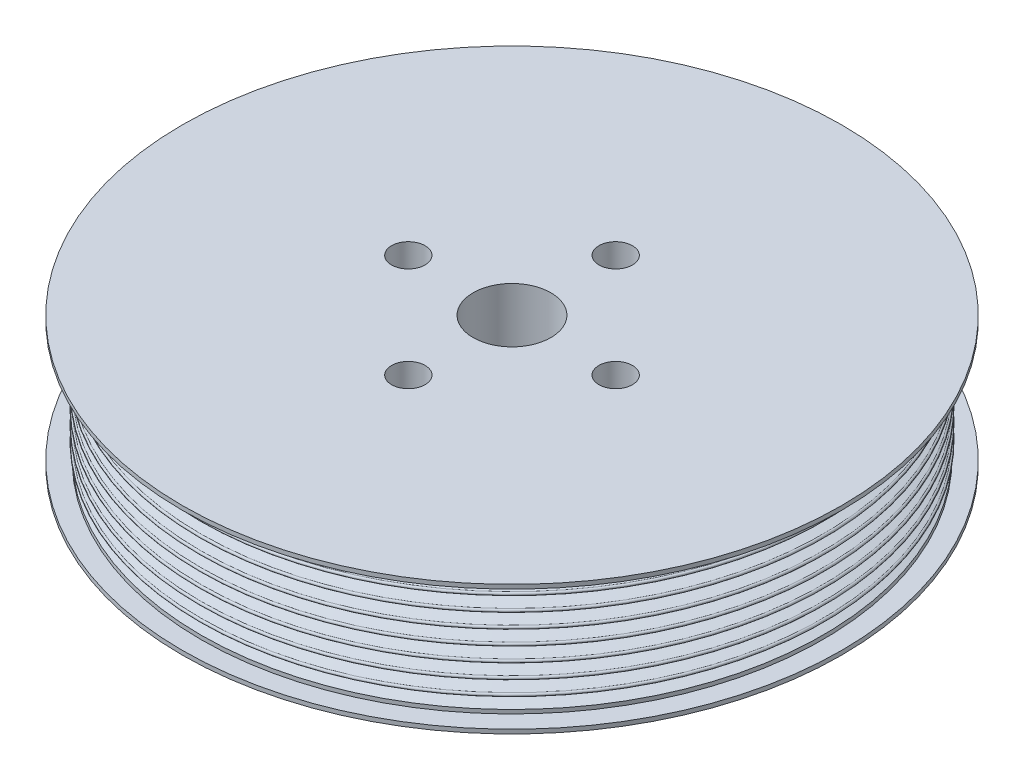
ISO-10303-21;
HEADER;
FILE_DESCRIPTION(('STEP AP214'),'2;1');
FILE_NAME('part.step','',(''),(''),'','','');
FILE_SCHEMA(('AUTOMOTIVE_DESIGN { 1 0 10303 214 1 1 1 1 }'));
ENDSEC;
DATA;
#1=APPLICATION_CONTEXT('core data for automotive mechanical design processes');
#2=APPLICATION_PROTOCOL_DEFINITION('international standard','automotive_design',2000,#1);
#3=PRODUCT_CONTEXT('',#1,'mechanical');
#4=PRODUCT('Part','Part','',(#3));
#5=PRODUCT_RELATED_PRODUCT_CATEGORY('part','',(#4));
#6=PRODUCT_DEFINITION_FORMATION('','',#4);
#7=PRODUCT_DEFINITION_CONTEXT('part definition',#1,'design');
#8=PRODUCT_DEFINITION('design','',#6,#7);
#9=PRODUCT_DEFINITION_SHAPE('','',#8);
#10=(LENGTH_UNIT() NAMED_UNIT(*) SI_UNIT(.MILLI.,.METRE.));
#11=(NAMED_UNIT(*) PLANE_ANGLE_UNIT() SI_UNIT($,.RADIAN.));
#12=(NAMED_UNIT(*) SI_UNIT($,.STERADIAN.) SOLID_ANGLE_UNIT());
#13=UNCERTAINTY_MEASURE_WITH_UNIT(LENGTH_MEASURE(1.E-05),#10,'distance_accuracy_value','');
#14=(GEOMETRIC_REPRESENTATION_CONTEXT(3) GLOBAL_UNCERTAINTY_ASSIGNED_CONTEXT((#13)) GLOBAL_UNIT_ASSIGNED_CONTEXT((#10,
#11,#12)) REPRESENTATION_CONTEXT('',''));
#15=CARTESIAN_POINT('',(0.,0.,0.));
#16=DIRECTION('',(0.,0.,1.));
#17=DIRECTION('',(1.,0.,0.));
#18=AXIS2_PLACEMENT_3D('',#15,#16,#17);
#19=CARTESIAN_POINT('',(80.772,-15.87246,0.));
#20=DIRECTION('',(0.,1.,0.));
#21=DIRECTION('',(0.,0.,1.));
#22=AXIS2_PLACEMENT_3D('',#19,#20,#21);
#23=PLANE('',#22);
#24=CARTESIAN_POINT('',(25.4,-15.87246,-2.62940275150013E-13));
#25=DIRECTION('',(0.,-1.,0.));
#26=DIRECTION('',(0.,0.,-1.));
#27=AXIS2_PLACEMENT_3D('',#24,#25,#26);
#28=CIRCLE('',#27,4.10209999999999);
#29=CARTESIAN_POINT('',(25.4,-15.87246,-4.10210000000025));
#30=VERTEX_POINT('',#29);
#31=EDGE_CURVE('E181',#30,#30,#28,.T.);
#32=ORIENTED_EDGE('',*,*,#31,.F.);
#33=EDGE_LOOP('',(#32));
#34=FACE_BOUND('',#33,.T.);
#35=CARTESIAN_POINT('',(0.,-15.87246,25.4));
#36=DIRECTION('',(0.,-1.,0.));
#37=DIRECTION('',(0.,0.,-1.));
#38=AXIS2_PLACEMENT_3D('',#35,#36,#37);
#39=CIRCLE('',#38,4.10209999999999);
#40=CARTESIAN_POINT('',(0.,-15.87246,21.2979));
#41=VERTEX_POINT('',#40);
#42=EDGE_CURVE('E175',#41,#41,#39,.T.);
#43=ORIENTED_EDGE('',*,*,#42,.F.);
#44=EDGE_LOOP('',(#43));
#45=FACE_BOUND('',#44,.T.);
#46=CARTESIAN_POINT('',(-25.4,-15.87246,0.));
#47=DIRECTION('',(0.,-1.,0.));
#48=DIRECTION('',(0.,0.,-1.));
#49=AXIS2_PLACEMENT_3D('',#46,#47,#48);
#50=CIRCLE('',#49,4.10209999999999);
#51=CARTESIAN_POINT('',(-25.4,-15.87246,-4.1020999999999));
#52=VERTEX_POINT('',#51);
#53=EDGE_CURVE('E169',#52,#52,#50,.T.);
#54=ORIENTED_EDGE('',*,*,#53,.F.);
#55=EDGE_LOOP('',(#54));
#56=FACE_BOUND('',#55,.T.);
#57=CARTESIAN_POINT('',(0.,-15.87246,-25.4));
#58=DIRECTION('',(0.,-1.,0.));
#59=DIRECTION('',(0.,0.,-1.));
#60=AXIS2_PLACEMENT_3D('',#57,#58,#59);
#61=CIRCLE('',#60,4.10209999999999);
#62=CARTESIAN_POINT('',(0.,-15.87246,-29.5021));
#63=VERTEX_POINT('',#62);
#64=EDGE_CURVE('E163',#63,#63,#61,.T.);
#65=ORIENTED_EDGE('',*,*,#64,.F.);
#66=EDGE_LOOP('',(#65));
#67=FACE_BOUND('',#66,.T.);
#68=CARTESIAN_POINT('',(0.,-15.87246,0.));
#69=DIRECTION('',(0.,1.,0.));
#70=DIRECTION('',(0.,0.,1.));
#71=AXIS2_PLACEMENT_3D('',#68,#69,#70);
#72=CIRCLE('',#71,9.525);
#73=CARTESIAN_POINT('',(0.,-15.87246,9.525));
#74=VERTEX_POINT('',#73);
#75=EDGE_CURVE('E154',#74,#74,#72,.T.);
#76=ORIENTED_EDGE('',*,*,#75,.T.);
#77=EDGE_LOOP('',(#76));
#78=FACE_BOUND('',#77,.T.);
#79=CARTESIAN_POINT('',(0.,-15.87246,0.));
#80=DIRECTION('',(0.,1.,0.));
#81=DIRECTION('',(0.,0.,1.));
#82=AXIS2_PLACEMENT_3D('',#79,#80,#81);
#83=CIRCLE('',#82,80.772);
#84=CARTESIAN_POINT('',(0.,-15.87246,80.772));
#85=VERTEX_POINT('',#84);
#86=EDGE_CURVE('E10',#85,#85,#83,.T.);
#87=ORIENTED_EDGE('',*,*,#86,.F.);
#88=EDGE_LOOP('',(#87));
#89=FACE_BOUND('',#88,.T.);
#90=ADVANCED_FACE('F33',(#34,#45,#56,#67,#78,#89),#23,.F.);
#91=CARTESIAN_POINT('',(0.,15.87246,0.));
#92=DIRECTION('',(0.,1.,0.));
#93=DIRECTION('',(0.,0.,1.));
#94=AXIS2_PLACEMENT_3D('',#91,#92,#93);
#95=CYLINDRICAL_SURFACE('',#94,80.772);
#96=CARTESIAN_POINT('',(0.,-14.85646,0.));
#97=DIRECTION('',(0.,1.,0.));
#98=DIRECTION('',(0.,0.,1.));
#99=AXIS2_PLACEMENT_3D('',#96,#97,#98);
#100=CIRCLE('',#99,80.772);
#101=CARTESIAN_POINT('',(0.,-14.85646,80.772));
#102=VERTEX_POINT('',#101);
#103=EDGE_CURVE('E39',#102,#102,#100,.T.);
#104=ORIENTED_EDGE('',*,*,#103,.F.);
#105=EDGE_LOOP('',(#104));
#106=FACE_BOUND('',#105,.T.);
#107=ORIENTED_EDGE('',*,*,#86,.T.);
#108=EDGE_LOOP('',(#107));
#109=FACE_BOUND('',#108,.T.);
#110=ADVANCED_FACE('F189',(#106,#109),#95,.T.);
#111=CARTESIAN_POINT('',(80.772,-14.85646,0.));
#112=DIRECTION('',(0.,-1.,0.));
#113=DIRECTION('',(0.,0.,-1.));
#114=AXIS2_PLACEMENT_3D('',#111,#112,#113);
#115=PLANE('',#114);
#116=CARTESIAN_POINT('',(0.,-14.85646,0.));
#117=DIRECTION('',(0.,1.,0.));
#118=DIRECTION('',(0.,0.,1.));
#119=AXIS2_PLACEMENT_3D('',#116,#117,#118);
#120=CIRCLE('',#119,76.2);
#121=CARTESIAN_POINT('',(0.,-14.85646,76.2));
#122=VERTEX_POINT('',#121);
#123=EDGE_CURVE('E43',#122,#122,#120,.T.);
#124=ORIENTED_EDGE('',*,*,#123,.F.);
#125=EDGE_LOOP('',(#124));
#126=FACE_BOUND('',#125,.T.);
#127=ORIENTED_EDGE('',*,*,#103,.T.);
#128=EDGE_LOOP('',(#127));
#129=FACE_BOUND('',#128,.T.);
#130=ADVANCED_FACE('F420',(#126,#129),#115,.F.);
#131=CARTESIAN_POINT('',(0.,15.87246,0.));
#132=DIRECTION('',(0.,1.,0.));
#133=DIRECTION('',(0.,0.,1.));
#134=AXIS2_PLACEMENT_3D('',#131,#132,#133);
#135=CYLINDRICAL_SURFACE('',#134,76.2);
#136=CARTESIAN_POINT('',(0.,-13.90396,0.));
#137=DIRECTION('',(0.,1.,0.));
#138=DIRECTION('',(0.,0.,1.));
#139=AXIS2_PLACEMENT_3D('',#136,#137,#138);
#140=CIRCLE('',#139,76.2);
#141=CARTESIAN_POINT('',(0.,-13.90396,76.2));
#142=VERTEX_POINT('',#141);
#143=EDGE_CURVE('E47',#142,#142,#140,.T.);
#144=ORIENTED_EDGE('',*,*,#143,.F.);
#145=EDGE_LOOP('',(#144));
#146=FACE_BOUND('',#145,.T.);
#147=ORIENTED_EDGE('',*,*,#123,.T.);
#148=EDGE_LOOP('',(#147));
#149=FACE_BOUND('',#148,.T.);
#150=ADVANCED_FACE('F414',(#146,#149),#135,.T.);
#151=CARTESIAN_POINT('',(0.,-13.90396,0.));
#152=DIRECTION('',(0.,-1.,0.));
#153=DIRECTION('',(0.,0.,-1.));
#154=AXIS2_PLACEMENT_3D('',#151,#152,#153);
#155=CONICAL_SURFACE('',#154,76.2,1.22173047639603);
#156=CARTESIAN_POINT('',(0.,-12.88034,0.));
#157=DIRECTION('',(0.,1.,0.));
#158=DIRECTION('',(0.,0.,1.));
#159=AXIS2_PLACEMENT_3D('',#156,#157,#158);
#160=CIRCLE('',#159,73.3876271638978);
#161=CARTESIAN_POINT('',(0.,-12.88034,73.3876271638978));
#162=VERTEX_POINT('',#161);
#163=EDGE_CURVE('E52',#162,#162,#160,.T.);
#164=ORIENTED_EDGE('',*,*,#163,.F.);
#165=EDGE_LOOP('',(#164));
#166=FACE_BOUND('',#165,.T.);
#167=ORIENTED_EDGE('',*,*,#143,.T.);
#168=EDGE_LOOP('',(#167));
#169=FACE_BOUND('',#168,.T.);
#170=ADVANCED_FACE('F408',(#166,#169),#155,.T.);
#171=CARTESIAN_POINT('',(0.,-12.49934,0.));
#172=DIRECTION('',(0.,1.,0.));
#173=DIRECTION('',(0.,0.,1.));
#174=AXIS2_PLACEMENT_3D('',#171,#172,#173);
#175=TOROIDAL_SURFACE('',#174,73.3876271638978,0.380999999999997);
#176=CARTESIAN_POINT('',(0.,-12.11834,0.));
#177=DIRECTION('',(0.,1.,0.));
#178=DIRECTION('',(0.,0.,1.));
#179=AXIS2_PLACEMENT_3D('',#176,#177,#178);
#180=CIRCLE('',#179,73.3876271638978);
#181=CARTESIAN_POINT('',(0.,-12.11834,73.3876271638978));
#182=VERTEX_POINT('',#181);
#183=EDGE_CURVE('E55',#182,#182,#180,.T.);
#184=ORIENTED_EDGE('',*,*,#183,.F.);
#185=EDGE_LOOP('',(#184));
#186=FACE_BOUND('',#185,.T.);
#187=ORIENTED_EDGE('',*,*,#163,.T.);
#188=EDGE_LOOP('',(#187));
#189=FACE_BOUND('',#188,.T.);
#190=ADVANCED_FACE('F402',(#186,#189),#175,.F.);
#191=CARTESIAN_POINT('',(0.,-12.11834,0.));
#192=DIRECTION('',(0.,1.,0.));
#193=DIRECTION('',(0.,0.,1.));
#194=AXIS2_PLACEMENT_3D('',#191,#192,#193);
#195=CONICAL_SURFACE('',#194,73.3876271638978,1.22173047639604);
#196=CARTESIAN_POINT('',(0.,-11.09472,0.));
#197=DIRECTION('',(0.,1.,0.));
#198=DIRECTION('',(0.,0.,1.));
#199=AXIS2_PLACEMENT_3D('',#196,#197,#198);
#200=CIRCLE('',#199,76.2);
#201=CARTESIAN_POINT('',(0.,-11.09472,76.2));
#202=VERTEX_POINT('',#201);
#203=EDGE_CURVE('E58',#202,#202,#200,.T.);
#204=ORIENTED_EDGE('',*,*,#203,.F.);
#205=EDGE_LOOP('',(#204));
#206=FACE_BOUND('',#205,.T.);
#207=ORIENTED_EDGE('',*,*,#183,.T.);
#208=EDGE_LOOP('',(#207));
#209=FACE_BOUND('',#208,.T.);
#210=ADVANCED_FACE('F396',(#206,#209),#195,.T.);
#211=CARTESIAN_POINT('',(0.,-10.71372,0.));
#212=DIRECTION('',(0.,1.,0.));
#213=DIRECTION('',(0.,0.,1.));
#214=AXIS2_PLACEMENT_3D('',#211,#212,#213);
#215=TOROIDAL_SURFACE('',#214,76.2,0.380999999999998);
#216=CARTESIAN_POINT('',(0.,-10.33272,0.));
#217=DIRECTION('',(0.,1.,0.));
#218=DIRECTION('',(0.,0.,1.));
#219=AXIS2_PLACEMENT_3D('',#216,#217,#218);
#220=CIRCLE('',#219,76.2);
#221=CARTESIAN_POINT('',(0.,-10.33272,76.2));
#222=VERTEX_POINT('',#221);
#223=EDGE_CURVE('E61',#222,#222,#220,.T.);
#224=ORIENTED_EDGE('',*,*,#223,.F.);
#225=EDGE_LOOP('',(#224));
#226=FACE_BOUND('',#225,.T.);
#227=ORIENTED_EDGE('',*,*,#203,.T.);
#228=EDGE_LOOP('',(#227));
#229=FACE_BOUND('',#228,.T.);
#230=ADVANCED_FACE('F390',(#226,#229),#215,.T.);
#231=CARTESIAN_POINT('',(0.,-10.33272,0.));
#232=DIRECTION('',(0.,-1.,0.));
#233=DIRECTION('',(0.,0.,-1.));
#234=AXIS2_PLACEMENT_3D('',#231,#232,#233);
#235=CONICAL_SURFACE('',#234,76.2,1.22173047639603);
#236=CARTESIAN_POINT('',(0.,-9.30909999999998,0.));
#237=DIRECTION('',(0.,1.,0.));
#238=DIRECTION('',(0.,0.,1.));
#239=AXIS2_PLACEMENT_3D('',#236,#237,#238);
#240=CIRCLE('',#239,73.3876271638978);
#241=CARTESIAN_POINT('',(0.,-9.30909999999998,73.3876271638978));
#242=VERTEX_POINT('',#241);
#243=EDGE_CURVE('E64',#242,#242,#240,.T.);
#244=ORIENTED_EDGE('',*,*,#243,.F.);
#245=EDGE_LOOP('',(#244));
#246=FACE_BOUND('',#245,.T.);
#247=ORIENTED_EDGE('',*,*,#223,.T.);
#248=EDGE_LOOP('',(#247));
#249=FACE_BOUND('',#248,.T.);
#250=ADVANCED_FACE('F384',(#246,#249),#235,.T.);
#251=CARTESIAN_POINT('',(0.,-8.92809999999998,0.));
#252=DIRECTION('',(0.,1.,0.));
#253=DIRECTION('',(0.,0.,1.));
#254=AXIS2_PLACEMENT_3D('',#251,#252,#253);
#255=TOROIDAL_SURFACE('',#254,73.3876271638978,0.381);
#256=CARTESIAN_POINT('',(0.,-8.54709999999998,0.));
#257=DIRECTION('',(0.,1.,0.));
#258=DIRECTION('',(0.,0.,1.));
#259=AXIS2_PLACEMENT_3D('',#256,#257,#258);
#260=CIRCLE('',#259,73.3876271638978);
#261=CARTESIAN_POINT('',(0.,-8.54709999999998,73.3876271638978));
#262=VERTEX_POINT('',#261);
#263=EDGE_CURVE('E67',#262,#262,#260,.T.);
#264=ORIENTED_EDGE('',*,*,#263,.F.);
#265=EDGE_LOOP('',(#264));
#266=FACE_BOUND('',#265,.T.);
#267=ORIENTED_EDGE('',*,*,#243,.T.);
#268=EDGE_LOOP('',(#267));
#269=FACE_BOUND('',#268,.T.);
#270=ADVANCED_FACE('F378',(#266,#269),#255,.F.);
#271=CARTESIAN_POINT('',(0.,-8.54709999999998,0.));
#272=DIRECTION('',(0.,1.,0.));
#273=DIRECTION('',(0.,0.,1.));
#274=AXIS2_PLACEMENT_3D('',#271,#272,#273);
#275=CONICAL_SURFACE('',#274,73.3876271638978,1.22173047639604);
#276=CARTESIAN_POINT('',(0.,-7.52348,0.));
#277=DIRECTION('',(0.,1.,0.));
#278=DIRECTION('',(0.,0.,1.));
#279=AXIS2_PLACEMENT_3D('',#276,#277,#278);
#280=CIRCLE('',#279,76.2);
#281=CARTESIAN_POINT('',(0.,-7.52348,76.2));
#282=VERTEX_POINT('',#281);
#283=EDGE_CURVE('E70',#282,#282,#280,.T.);
#284=ORIENTED_EDGE('',*,*,#283,.F.);
#285=EDGE_LOOP('',(#284));
#286=FACE_BOUND('',#285,.T.);
#287=ORIENTED_EDGE('',*,*,#263,.T.);
#288=EDGE_LOOP('',(#287));
#289=FACE_BOUND('',#288,.T.);
#290=ADVANCED_FACE('F372',(#286,#289),#275,.T.);
#291=CARTESIAN_POINT('',(0.,-7.14248,0.));
#292=DIRECTION('',(0.,1.,0.));
#293=DIRECTION('',(0.,0.,1.));
#294=AXIS2_PLACEMENT_3D('',#291,#292,#293);
#295=TOROIDAL_SURFACE('',#294,76.2,0.380999999999999);
#296=CARTESIAN_POINT('',(0.,-6.76148,0.));
#297=DIRECTION('',(0.,1.,0.));
#298=DIRECTION('',(0.,0.,1.));
#299=AXIS2_PLACEMENT_3D('',#296,#297,#298);
#300=CIRCLE('',#299,76.2);
#301=CARTESIAN_POINT('',(0.,-6.76148,76.2));
#302=VERTEX_POINT('',#301);
#303=EDGE_CURVE('E73',#302,#302,#300,.T.);
#304=ORIENTED_EDGE('',*,*,#303,.F.);
#305=EDGE_LOOP('',(#304));
#306=FACE_BOUND('',#305,.T.);
#307=ORIENTED_EDGE('',*,*,#283,.T.);
#308=EDGE_LOOP('',(#307));
#309=FACE_BOUND('',#308,.T.);
#310=ADVANCED_FACE('F366',(#306,#309),#295,.T.);
#311=CARTESIAN_POINT('',(0.,-6.76148,0.));
#312=DIRECTION('',(0.,-1.,0.));
#313=DIRECTION('',(0.,0.,-1.));
#314=AXIS2_PLACEMENT_3D('',#311,#312,#313);
#315=CONICAL_SURFACE('',#314,76.2,1.22173047639603);
#316=CARTESIAN_POINT('',(0.,-5.73785999999998,0.));
#317=DIRECTION('',(0.,1.,0.));
#318=DIRECTION('',(0.,0.,1.));
#319=AXIS2_PLACEMENT_3D('',#316,#317,#318);
#320=CIRCLE('',#319,73.3876271638978);
#321=CARTESIAN_POINT('',(0.,-5.73785999999998,73.3876271638978));
#322=VERTEX_POINT('',#321);
#323=EDGE_CURVE('E76',#322,#322,#320,.T.);
#324=ORIENTED_EDGE('',*,*,#323,.F.);
#325=EDGE_LOOP('',(#324));
#326=FACE_BOUND('',#325,.T.);
#327=ORIENTED_EDGE('',*,*,#303,.T.);
#328=EDGE_LOOP('',(#327));
#329=FACE_BOUND('',#328,.T.);
#330=ADVANCED_FACE('F360',(#326,#329),#315,.T.);
#331=CARTESIAN_POINT('',(0.,-5.35685999999998,0.));
#332=DIRECTION('',(0.,1.,0.));
#333=DIRECTION('',(0.,0.,1.));
#334=AXIS2_PLACEMENT_3D('',#331,#332,#333);
#335=TOROIDAL_SURFACE('',#334,73.3876271638978,0.381);
#336=CARTESIAN_POINT('',(0.,-4.97585999999998,0.));
#337=DIRECTION('',(0.,1.,0.));
#338=DIRECTION('',(0.,0.,1.));
#339=AXIS2_PLACEMENT_3D('',#336,#337,#338);
#340=CIRCLE('',#339,73.3876271638978);
#341=CARTESIAN_POINT('',(0.,-4.97585999999998,73.3876271638978));
#342=VERTEX_POINT('',#341);
#343=EDGE_CURVE('E79',#342,#342,#340,.T.);
#344=ORIENTED_EDGE('',*,*,#343,.F.);
#345=EDGE_LOOP('',(#344));
#346=FACE_BOUND('',#345,.T.);
#347=ORIENTED_EDGE('',*,*,#323,.T.);
#348=EDGE_LOOP('',(#347));
#349=FACE_BOUND('',#348,.T.);
#350=ADVANCED_FACE('F354',(#346,#349),#335,.F.);
#351=CARTESIAN_POINT('',(0.,-4.97585999999998,0.));
#352=DIRECTION('',(0.,1.,0.));
#353=DIRECTION('',(0.,0.,1.));
#354=AXIS2_PLACEMENT_3D('',#351,#352,#353);
#355=CONICAL_SURFACE('',#354,73.3876271638978,1.22173047639604);
#356=CARTESIAN_POINT('',(0.,-3.95224,0.));
#357=DIRECTION('',(0.,1.,0.));
#358=DIRECTION('',(0.,0.,1.));
#359=AXIS2_PLACEMENT_3D('',#356,#357,#358);
#360=CIRCLE('',#359,76.2);
#361=CARTESIAN_POINT('',(0.,-3.95224,76.2));
#362=VERTEX_POINT('',#361);
#363=EDGE_CURVE('E82',#362,#362,#360,.T.);
#364=ORIENTED_EDGE('',*,*,#363,.F.);
#365=EDGE_LOOP('',(#364));
#366=FACE_BOUND('',#365,.T.);
#367=ORIENTED_EDGE('',*,*,#343,.T.);
#368=EDGE_LOOP('',(#367));
#369=FACE_BOUND('',#368,.T.);
#370=ADVANCED_FACE('F348',(#366,#369),#355,.T.);
#371=CARTESIAN_POINT('',(0.,-3.57123999999999,0.));
#372=DIRECTION('',(0.,1.,0.));
#373=DIRECTION('',(0.,0.,1.));
#374=AXIS2_PLACEMENT_3D('',#371,#372,#373);
#375=TOROIDAL_SURFACE('',#374,76.2,0.381000000000001);
#376=CARTESIAN_POINT('',(0.,-3.19023999999999,0.));
#377=DIRECTION('',(0.,1.,0.));
#378=DIRECTION('',(0.,0.,1.));
#379=AXIS2_PLACEMENT_3D('',#376,#377,#378);
#380=CIRCLE('',#379,76.2);
#381=CARTESIAN_POINT('',(0.,-3.19023999999999,76.2));
#382=VERTEX_POINT('',#381);
#383=EDGE_CURVE('E85',#382,#382,#380,.T.);
#384=ORIENTED_EDGE('',*,*,#383,.F.);
#385=EDGE_LOOP('',(#384));
#386=FACE_BOUND('',#385,.T.);
#387=ORIENTED_EDGE('',*,*,#363,.T.);
#388=EDGE_LOOP('',(#387));
#389=FACE_BOUND('',#388,.T.);
#390=ADVANCED_FACE('F342',(#386,#389),#375,.T.);
#391=CARTESIAN_POINT('',(0.,-3.19023999999999,0.));
#392=DIRECTION('',(0.,-1.,0.));
#393=DIRECTION('',(0.,0.,-1.));
#394=AXIS2_PLACEMENT_3D('',#391,#392,#393);
#395=CONICAL_SURFACE('',#394,76.2,1.22173047639603);
#396=CARTESIAN_POINT('',(0.,-2.16661999999999,0.));
#397=DIRECTION('',(0.,1.,0.));
#398=DIRECTION('',(0.,0.,1.));
#399=AXIS2_PLACEMENT_3D('',#396,#397,#398);
#400=CIRCLE('',#399,73.3876271638978);
#401=CARTESIAN_POINT('',(0.,-2.16661999999999,73.3876271638978));
#402=VERTEX_POINT('',#401);
#403=EDGE_CURVE('E88',#402,#402,#400,.T.);
#404=ORIENTED_EDGE('',*,*,#403,.F.);
#405=EDGE_LOOP('',(#404));
#406=FACE_BOUND('',#405,.T.);
#407=ORIENTED_EDGE('',*,*,#383,.T.);
#408=EDGE_LOOP('',(#407));
#409=FACE_BOUND('',#408,.T.);
#410=ADVANCED_FACE('F336',(#406,#409),#395,.T.);
#411=CARTESIAN_POINT('',(0.,-1.78561999999999,0.));
#412=DIRECTION('',(0.,1.,0.));
#413=DIRECTION('',(0.,0.,1.));
#414=AXIS2_PLACEMENT_3D('',#411,#412,#413);
#415=TOROIDAL_SURFACE('',#414,73.3876271638978,0.381);
#416=CARTESIAN_POINT('',(0.,-1.40461999999999,0.));
#417=DIRECTION('',(0.,1.,0.));
#418=DIRECTION('',(0.,0.,1.));
#419=AXIS2_PLACEMENT_3D('',#416,#417,#418);
#420=CIRCLE('',#419,73.3876271638978);
#421=CARTESIAN_POINT('',(0.,-1.40461999999999,73.3876271638978));
#422=VERTEX_POINT('',#421);
#423=EDGE_CURVE('E91',#422,#422,#420,.T.);
#424=ORIENTED_EDGE('',*,*,#423,.F.);
#425=EDGE_LOOP('',(#424));
#426=FACE_BOUND('',#425,.T.);
#427=ORIENTED_EDGE('',*,*,#403,.T.);
#428=EDGE_LOOP('',(#427));
#429=FACE_BOUND('',#428,.T.);
#430=ADVANCED_FACE('F330',(#426,#429),#415,.F.);
#431=CARTESIAN_POINT('',(0.,-1.40461999999999,0.));
#432=DIRECTION('',(0.,1.,0.));
#433=DIRECTION('',(0.,0.,1.));
#434=AXIS2_PLACEMENT_3D('',#431,#432,#433);
#435=CONICAL_SURFACE('',#434,73.3876271638978,1.22173047639604);
#436=CARTESIAN_POINT('',(0.,-0.381000000000003,0.));
#437=DIRECTION('',(0.,1.,0.));
#438=DIRECTION('',(0.,0.,1.));
#439=AXIS2_PLACEMENT_3D('',#436,#437,#438);
#440=CIRCLE('',#439,76.2);
#441=CARTESIAN_POINT('',(0.,-0.381000000000003,76.2));
#442=VERTEX_POINT('',#441);
#443=EDGE_CURVE('E94',#442,#442,#440,.T.);
#444=ORIENTED_EDGE('',*,*,#443,.F.);
#445=EDGE_LOOP('',(#444));
#446=FACE_BOUND('',#445,.T.);
#447=ORIENTED_EDGE('',*,*,#423,.T.);
#448=EDGE_LOOP('',(#447));
#449=FACE_BOUND('',#448,.T.);
#450=ADVANCED_FACE('F324',(#446,#449),#435,.T.);
#451=CARTESIAN_POINT('',(0.,0.,0.));
#452=DIRECTION('',(0.,1.,0.));
#453=DIRECTION('',(0.,0.,1.));
#454=AXIS2_PLACEMENT_3D('',#451,#452,#453);
#455=TOROIDAL_SURFACE('',#454,76.2,0.381000000000001);
#456=CARTESIAN_POINT('',(0.,0.380999999999999,0.));
#457=DIRECTION('',(0.,1.,0.));
#458=DIRECTION('',(0.,0.,1.));
#459=AXIS2_PLACEMENT_3D('',#456,#457,#458);
#460=CIRCLE('',#459,76.2);
#461=CARTESIAN_POINT('',(0.,0.380999999999999,76.2));
#462=VERTEX_POINT('',#461);
#463=EDGE_CURVE('E97',#462,#462,#460,.T.);
#464=ORIENTED_EDGE('',*,*,#463,.F.);
#465=EDGE_LOOP('',(#464));
#466=FACE_BOUND('',#465,.T.);
#467=ORIENTED_EDGE('',*,*,#443,.T.);
#468=EDGE_LOOP('',(#467));
#469=FACE_BOUND('',#468,.T.);
#470=ADVANCED_FACE('F318',(#466,#469),#455,.T.);
#471=CARTESIAN_POINT('',(0.,0.380999999999999,0.));
#472=DIRECTION('',(0.,-1.,0.));
#473=DIRECTION('',(0.,0.,-1.));
#474=AXIS2_PLACEMENT_3D('',#471,#472,#473);
#475=CONICAL_SURFACE('',#474,76.2,1.22173047639603);
#476=CARTESIAN_POINT('',(0.,1.40462000000001,0.));
#477=DIRECTION('',(0.,1.,0.));
#478=DIRECTION('',(0.,0.,1.));
#479=AXIS2_PLACEMENT_3D('',#476,#477,#478);
#480=CIRCLE('',#479,73.3876271638978);
#481=CARTESIAN_POINT('',(0.,1.40462000000001,73.3876271638978));
#482=VERTEX_POINT('',#481);
#483=EDGE_CURVE('E100',#482,#482,#480,.T.);
#484=ORIENTED_EDGE('',*,*,#483,.F.);
#485=EDGE_LOOP('',(#484));
#486=FACE_BOUND('',#485,.T.);
#487=ORIENTED_EDGE('',*,*,#463,.T.);
#488=EDGE_LOOP('',(#487));
#489=FACE_BOUND('',#488,.T.);
#490=ADVANCED_FACE('F312',(#486,#489),#475,.T.);
#491=CARTESIAN_POINT('',(0.,1.78562000000001,0.));
#492=DIRECTION('',(0.,1.,0.));
#493=DIRECTION('',(0.,0.,1.));
#494=AXIS2_PLACEMENT_3D('',#491,#492,#493);
#495=TOROIDAL_SURFACE('',#494,73.3876271638978,0.381);
#496=CARTESIAN_POINT('',(0.,2.16662000000001,0.));
#497=DIRECTION('',(0.,1.,0.));
#498=DIRECTION('',(0.,0.,1.));
#499=AXIS2_PLACEMENT_3D('',#496,#497,#498);
#500=CIRCLE('',#499,73.3876271638978);
#501=CARTESIAN_POINT('',(0.,2.16662000000001,73.3876271638978));
#502=VERTEX_POINT('',#501);
#503=EDGE_CURVE('E103',#502,#502,#500,.T.);
#504=ORIENTED_EDGE('',*,*,#503,.F.);
#505=EDGE_LOOP('',(#504));
#506=FACE_BOUND('',#505,.T.);
#507=ORIENTED_EDGE('',*,*,#483,.T.);
#508=EDGE_LOOP('',(#507));
#509=FACE_BOUND('',#508,.T.);
#510=ADVANCED_FACE('F306',(#506,#509),#495,.F.);
#511=CARTESIAN_POINT('',(0.,2.16662000000001,0.));
#512=DIRECTION('',(0.,1.,0.));
#513=DIRECTION('',(0.,0.,1.));
#514=AXIS2_PLACEMENT_3D('',#511,#512,#513);
#515=CONICAL_SURFACE('',#514,73.3876271638978,1.22173047639604);
#516=CARTESIAN_POINT('',(0.,3.19024,0.));
#517=DIRECTION('',(0.,1.,0.));
#518=DIRECTION('',(0.,0.,1.));
#519=AXIS2_PLACEMENT_3D('',#516,#517,#518);
#520=CIRCLE('',#519,76.2);
#521=CARTESIAN_POINT('',(0.,3.19024,76.2));
#522=VERTEX_POINT('',#521);
#523=EDGE_CURVE('E106',#522,#522,#520,.T.);
#524=ORIENTED_EDGE('',*,*,#523,.F.);
#525=EDGE_LOOP('',(#524));
#526=FACE_BOUND('',#525,.T.);
#527=ORIENTED_EDGE('',*,*,#503,.T.);
#528=EDGE_LOOP('',(#527));
#529=FACE_BOUND('',#528,.T.);
#530=ADVANCED_FACE('F300',(#526,#529),#515,.T.);
#531=CARTESIAN_POINT('',(0.,3.57124,0.));
#532=DIRECTION('',(0.,1.,0.));
#533=DIRECTION('',(0.,0.,1.));
#534=AXIS2_PLACEMENT_3D('',#531,#532,#533);
#535=TOROIDAL_SURFACE('',#534,76.2,0.381);
#536=CARTESIAN_POINT('',(0.,3.95224,0.));
#537=DIRECTION('',(0.,1.,0.));
#538=DIRECTION('',(0.,0.,1.));
#539=AXIS2_PLACEMENT_3D('',#536,#537,#538);
#540=CIRCLE('',#539,76.2);
#541=CARTESIAN_POINT('',(0.,3.95224,76.2));
#542=VERTEX_POINT('',#541);
#543=EDGE_CURVE('E109',#542,#542,#540,.T.);
#544=ORIENTED_EDGE('',*,*,#543,.F.);
#545=EDGE_LOOP('',(#544));
#546=FACE_BOUND('',#545,.T.);
#547=ORIENTED_EDGE('',*,*,#523,.T.);
#548=EDGE_LOOP('',(#547));
#549=FACE_BOUND('',#548,.T.);
#550=ADVANCED_FACE('F294',(#546,#549),#535,.T.);
#551=CARTESIAN_POINT('',(0.,3.95224,0.));
#552=DIRECTION('',(0.,-1.,0.));
#553=DIRECTION('',(0.,0.,-1.));
#554=AXIS2_PLACEMENT_3D('',#551,#552,#553);
#555=CONICAL_SURFACE('',#554,76.2,1.22173047639603);
#556=CARTESIAN_POINT('',(0.,4.97586000000001,0.));
#557=DIRECTION('',(0.,1.,0.));
#558=DIRECTION('',(0.,0.,1.));
#559=AXIS2_PLACEMENT_3D('',#556,#557,#558);
#560=CIRCLE('',#559,73.3876271638978);
#561=CARTESIAN_POINT('',(0.,4.97586000000001,73.3876271638978));
#562=VERTEX_POINT('',#561);
#563=EDGE_CURVE('E112',#562,#562,#560,.T.);
#564=ORIENTED_EDGE('',*,*,#563,.F.);
#565=EDGE_LOOP('',(#564));
#566=FACE_BOUND('',#565,.T.);
#567=ORIENTED_EDGE('',*,*,#543,.T.);
#568=EDGE_LOOP('',(#567));
#569=FACE_BOUND('',#568,.T.);
#570=ADVANCED_FACE('F288',(#566,#569),#555,.T.);
#571=CARTESIAN_POINT('',(0.,5.35686000000001,0.));
#572=DIRECTION('',(0.,1.,0.));
#573=DIRECTION('',(0.,0.,1.));
#574=AXIS2_PLACEMENT_3D('',#571,#572,#573);
#575=TOROIDAL_SURFACE('',#574,73.3876271638978,0.381);
#576=CARTESIAN_POINT('',(0.,5.73786000000001,0.));
#577=DIRECTION('',(0.,1.,0.));
#578=DIRECTION('',(0.,0.,1.));
#579=AXIS2_PLACEMENT_3D('',#576,#577,#578);
#580=CIRCLE('',#579,73.3876271638978);
#581=CARTESIAN_POINT('',(0.,5.73786000000001,73.3876271638978));
#582=VERTEX_POINT('',#581);
#583=EDGE_CURVE('E115',#582,#582,#580,.T.);
#584=ORIENTED_EDGE('',*,*,#583,.F.);
#585=EDGE_LOOP('',(#584));
#586=FACE_BOUND('',#585,.T.);
#587=ORIENTED_EDGE('',*,*,#563,.T.);
#588=EDGE_LOOP('',(#587));
#589=FACE_BOUND('',#588,.T.);
#590=ADVANCED_FACE('F282',(#586,#589),#575,.F.);
#591=CARTESIAN_POINT('',(0.,5.73786000000001,0.));
#592=DIRECTION('',(0.,1.,0.));
#593=DIRECTION('',(0.,0.,1.));
#594=AXIS2_PLACEMENT_3D('',#591,#592,#593);
#595=CONICAL_SURFACE('',#594,73.3876271638978,1.22173047639604);
#596=CARTESIAN_POINT('',(0.,6.76148,0.));
#597=DIRECTION('',(0.,1.,0.));
#598=DIRECTION('',(0.,0.,1.));
#599=AXIS2_PLACEMENT_3D('',#596,#597,#598);
#600=CIRCLE('',#599,76.2);
#601=CARTESIAN_POINT('',(0.,6.76148,76.2));
#602=VERTEX_POINT('',#601);
#603=EDGE_CURVE('E118',#602,#602,#600,.T.);
#604=ORIENTED_EDGE('',*,*,#603,.F.);
#605=EDGE_LOOP('',(#604));
#606=FACE_BOUND('',#605,.T.);
#607=ORIENTED_EDGE('',*,*,#583,.T.);
#608=EDGE_LOOP('',(#607));
#609=FACE_BOUND('',#608,.T.);
#610=ADVANCED_FACE('F276',(#606,#609),#595,.T.);
#611=CARTESIAN_POINT('',(0.,7.14248,0.));
#612=DIRECTION('',(0.,1.,0.));
#613=DIRECTION('',(0.,0.,1.));
#614=AXIS2_PLACEMENT_3D('',#611,#612,#613);
#615=TOROIDAL_SURFACE('',#614,76.2,0.381000000000001);
#616=CARTESIAN_POINT('',(0.,7.52348,0.));
#617=DIRECTION('',(0.,1.,0.));
#618=DIRECTION('',(0.,0.,1.));
#619=AXIS2_PLACEMENT_3D('',#616,#617,#618);
#620=CIRCLE('',#619,76.2);
#621=CARTESIAN_POINT('',(0.,7.52348,76.2));
#622=VERTEX_POINT('',#621);
#623=EDGE_CURVE('E121',#622,#622,#620,.T.);
#624=ORIENTED_EDGE('',*,*,#623,.F.);
#625=EDGE_LOOP('',(#624));
#626=FACE_BOUND('',#625,.T.);
#627=ORIENTED_EDGE('',*,*,#603,.T.);
#628=EDGE_LOOP('',(#627));
#629=FACE_BOUND('',#628,.T.);
#630=ADVANCED_FACE('F270',(#626,#629),#615,.T.);
#631=CARTESIAN_POINT('',(0.,7.52348,0.));
#632=DIRECTION('',(0.,-1.,0.));
#633=DIRECTION('',(0.,0.,-1.));
#634=AXIS2_PLACEMENT_3D('',#631,#632,#633);
#635=CONICAL_SURFACE('',#634,76.2,1.22173047639603);
#636=CARTESIAN_POINT('',(0.,8.5471,0.));
#637=DIRECTION('',(0.,1.,0.));
#638=DIRECTION('',(0.,0.,1.));
#639=AXIS2_PLACEMENT_3D('',#636,#637,#638);
#640=CIRCLE('',#639,73.3876271638978);
#641=CARTESIAN_POINT('',(0.,8.5471,73.3876271638978));
#642=VERTEX_POINT('',#641);
#643=EDGE_CURVE('E124',#642,#642,#640,.T.);
#644=ORIENTED_EDGE('',*,*,#643,.F.);
#645=EDGE_LOOP('',(#644));
#646=FACE_BOUND('',#645,.T.);
#647=ORIENTED_EDGE('',*,*,#623,.T.);
#648=EDGE_LOOP('',(#647));
#649=FACE_BOUND('',#648,.T.);
#650=ADVANCED_FACE('F264',(#646,#649),#635,.T.);
#651=CARTESIAN_POINT('',(0.,8.9281,0.));
#652=DIRECTION('',(0.,1.,0.));
#653=DIRECTION('',(0.,0.,1.));
#654=AXIS2_PLACEMENT_3D('',#651,#652,#653);
#655=TOROIDAL_SURFACE('',#654,73.3876271638978,0.381000000000001);
#656=CARTESIAN_POINT('',(0.,9.30910000000001,0.));
#657=DIRECTION('',(0.,1.,0.));
#658=DIRECTION('',(0.,0.,1.));
#659=AXIS2_PLACEMENT_3D('',#656,#657,#658);
#660=CIRCLE('',#659,73.3876271638978);
#661=CARTESIAN_POINT('',(0.,9.30910000000001,73.3876271638978));
#662=VERTEX_POINT('',#661);
#663=EDGE_CURVE('E127',#662,#662,#660,.T.);
#664=ORIENTED_EDGE('',*,*,#663,.F.);
#665=EDGE_LOOP('',(#664));
#666=FACE_BOUND('',#665,.T.);
#667=ORIENTED_EDGE('',*,*,#643,.T.);
#668=EDGE_LOOP('',(#667));
#669=FACE_BOUND('',#668,.T.);
#670=ADVANCED_FACE('F258',(#666,#669),#655,.F.);
#671=CARTESIAN_POINT('',(0.,9.30910000000001,0.));
#672=DIRECTION('',(0.,1.,0.));
#673=DIRECTION('',(0.,0.,1.));
#674=AXIS2_PLACEMENT_3D('',#671,#672,#673);
#675=CONICAL_SURFACE('',#674,73.3876271638978,1.22173047639604);
#676=CARTESIAN_POINT('',(0.,10.33272,0.));
#677=DIRECTION('',(0.,1.,0.));
#678=DIRECTION('',(0.,0.,1.));
#679=AXIS2_PLACEMENT_3D('',#676,#677,#678);
#680=CIRCLE('',#679,76.2);
#681=CARTESIAN_POINT('',(0.,10.33272,76.2));
#682=VERTEX_POINT('',#681);
#683=EDGE_CURVE('E130',#682,#682,#680,.T.);
#684=ORIENTED_EDGE('',*,*,#683,.F.);
#685=EDGE_LOOP('',(#684));
#686=FACE_BOUND('',#685,.T.);
#687=ORIENTED_EDGE('',*,*,#663,.T.);
#688=EDGE_LOOP('',(#687));
#689=FACE_BOUND('',#688,.T.);
#690=ADVANCED_FACE('F252',(#686,#689),#675,.T.);
#691=CARTESIAN_POINT('',(0.,10.71372,0.));
#692=DIRECTION('',(0.,1.,0.));
#693=DIRECTION('',(0.,0.,1.));
#694=AXIS2_PLACEMENT_3D('',#691,#692,#693);
#695=TOROIDAL_SURFACE('',#694,76.2,0.381000000000001);
#696=CARTESIAN_POINT('',(0.,11.09472,0.));
#697=DIRECTION('',(0.,1.,0.));
#698=DIRECTION('',(0.,0.,1.));
#699=AXIS2_PLACEMENT_3D('',#696,#697,#698);
#700=CIRCLE('',#699,76.2);
#701=CARTESIAN_POINT('',(0.,11.09472,76.2));
#702=VERTEX_POINT('',#701);
#703=EDGE_CURVE('E133',#702,#702,#700,.T.);
#704=ORIENTED_EDGE('',*,*,#703,.F.);
#705=EDGE_LOOP('',(#704));
#706=FACE_BOUND('',#705,.T.);
#707=ORIENTED_EDGE('',*,*,#683,.T.);
#708=EDGE_LOOP('',(#707));
#709=FACE_BOUND('',#708,.T.);
#710=ADVANCED_FACE('F246',(#706,#709),#695,.T.);
#711=CARTESIAN_POINT('',(0.,11.09472,0.));
#712=DIRECTION('',(0.,-1.,0.));
#713=DIRECTION('',(0.,0.,-1.));
#714=AXIS2_PLACEMENT_3D('',#711,#712,#713);
#715=CONICAL_SURFACE('',#714,76.2,1.22173047639603);
#716=CARTESIAN_POINT('',(0.,12.11834,0.));
#717=DIRECTION('',(0.,1.,0.));
#718=DIRECTION('',(0.,0.,1.));
#719=AXIS2_PLACEMENT_3D('',#716,#717,#718);
#720=CIRCLE('',#719,73.3876271638978);
#721=CARTESIAN_POINT('',(0.,12.11834,73.3876271638978));
#722=VERTEX_POINT('',#721);
#723=EDGE_CURVE('E136',#722,#722,#720,.T.);
#724=ORIENTED_EDGE('',*,*,#723,.F.);
#725=EDGE_LOOP('',(#724));
#726=FACE_BOUND('',#725,.T.);
#727=ORIENTED_EDGE('',*,*,#703,.T.);
#728=EDGE_LOOP('',(#727));
#729=FACE_BOUND('',#728,.T.);
#730=ADVANCED_FACE('F240',(#726,#729),#715,.T.);
#731=CARTESIAN_POINT('',(0.,12.49934,0.));
#732=DIRECTION('',(0.,1.,0.));
#733=DIRECTION('',(0.,0.,1.));
#734=AXIS2_PLACEMENT_3D('',#731,#732,#733);
#735=TOROIDAL_SURFACE('',#734,73.3876271638978,0.380999999999999);
#736=CARTESIAN_POINT('',(0.,12.88034,0.));
#737=DIRECTION('',(0.,1.,0.));
#738=DIRECTION('',(0.,0.,1.));
#739=AXIS2_PLACEMENT_3D('',#736,#737,#738);
#740=CIRCLE('',#739,73.3876271638978);
#741=CARTESIAN_POINT('',(0.,12.88034,73.3876271638978));
#742=VERTEX_POINT('',#741);
#743=EDGE_CURVE('E139',#742,#742,#740,.T.);
#744=ORIENTED_EDGE('',*,*,#743,.F.);
#745=EDGE_LOOP('',(#744));
#746=FACE_BOUND('',#745,.T.);
#747=ORIENTED_EDGE('',*,*,#723,.T.);
#748=EDGE_LOOP('',(#747));
#749=FACE_BOUND('',#748,.T.);
#750=ADVANCED_FACE('F234',(#746,#749),#735,.F.);
#751=CARTESIAN_POINT('',(0.,12.88034,0.));
#752=DIRECTION('',(0.,1.,0.));
#753=DIRECTION('',(0.,0.,1.));
#754=AXIS2_PLACEMENT_3D('',#751,#752,#753);
#755=CONICAL_SURFACE('',#754,73.3876271638978,1.22173047639604);
#756=CARTESIAN_POINT('',(0.,13.90396,0.));
#757=DIRECTION('',(0.,1.,0.));
#758=DIRECTION('',(0.,0.,1.));
#759=AXIS2_PLACEMENT_3D('',#756,#757,#758);
#760=CIRCLE('',#759,76.2);
#761=CARTESIAN_POINT('',(0.,13.90396,76.2));
#762=VERTEX_POINT('',#761);
#763=EDGE_CURVE('E142',#762,#762,#760,.T.);
#764=ORIENTED_EDGE('',*,*,#763,.F.);
#765=EDGE_LOOP('',(#764));
#766=FACE_BOUND('',#765,.T.);
#767=ORIENTED_EDGE('',*,*,#743,.T.);
#768=EDGE_LOOP('',(#767));
#769=FACE_BOUND('',#768,.T.);
#770=ADVANCED_FACE('F228',(#766,#769),#755,.T.);
#771=CARTESIAN_POINT('',(0.,15.87246,0.));
#772=DIRECTION('',(0.,1.,0.));
#773=DIRECTION('',(0.,0.,1.));
#774=AXIS2_PLACEMENT_3D('',#771,#772,#773);
#775=CYLINDRICAL_SURFACE('',#774,76.2);
#776=CARTESIAN_POINT('',(0.,14.85646,0.));
#777=DIRECTION('',(0.,1.,0.));
#778=DIRECTION('',(0.,0.,1.));
#779=AXIS2_PLACEMENT_3D('',#776,#777,#778);
#780=CIRCLE('',#779,76.2);
#781=CARTESIAN_POINT('',(0.,14.85646,76.2));
#782=VERTEX_POINT('',#781);
#783=EDGE_CURVE('E145',#782,#782,#780,.T.);
#784=ORIENTED_EDGE('',*,*,#783,.F.);
#785=EDGE_LOOP('',(#784));
#786=FACE_BOUND('',#785,.T.);
#787=ORIENTED_EDGE('',*,*,#763,.T.);
#788=EDGE_LOOP('',(#787));
#789=FACE_BOUND('',#788,.T.);
#790=ADVANCED_FACE('F222',(#786,#789),#775,.T.);
#791=CARTESIAN_POINT('',(80.772,14.85646,0.));
#792=DIRECTION('',(0.,1.,0.));
#793=DIRECTION('',(0.,0.,1.));
#794=AXIS2_PLACEMENT_3D('',#791,#792,#793);
#795=PLANE('',#794);
#796=CARTESIAN_POINT('',(0.,14.85646,0.));
#797=DIRECTION('',(0.,1.,0.));
#798=DIRECTION('',(0.,0.,1.));
#799=AXIS2_PLACEMENT_3D('',#796,#797,#798);
#800=CIRCLE('',#799,80.772);
#801=CARTESIAN_POINT('',(0.,14.85646,80.772));
#802=VERTEX_POINT('',#801);
#803=EDGE_CURVE('E148',#802,#802,#800,.T.);
#804=ORIENTED_EDGE('',*,*,#803,.F.);
#805=EDGE_LOOP('',(#804));
#806=FACE_BOUND('',#805,.T.);
#807=ORIENTED_EDGE('',*,*,#783,.T.);
#808=EDGE_LOOP('',(#807));
#809=FACE_BOUND('',#808,.T.);
#810=ADVANCED_FACE('F216',(#806,#809),#795,.F.);
#811=CARTESIAN_POINT('',(0.,15.87246,0.));
#812=DIRECTION('',(0.,1.,0.));
#813=DIRECTION('',(0.,0.,1.));
#814=AXIS2_PLACEMENT_3D('',#811,#812,#813);
#815=CYLINDRICAL_SURFACE('',#814,80.772);
#816=CARTESIAN_POINT('',(0.,15.87246,0.));
#817=DIRECTION('',(0.,1.,0.));
#818=DIRECTION('',(0.,0.,1.));
#819=AXIS2_PLACEMENT_3D('',#816,#817,#818);
#820=CIRCLE('',#819,80.772);
#821=CARTESIAN_POINT('',(0.,15.87246,80.772));
#822=VERTEX_POINT('',#821);
#823=EDGE_CURVE('E151',#822,#822,#820,.T.);
#824=ORIENTED_EDGE('',*,*,#823,.F.);
#825=EDGE_LOOP('',(#824));
#826=FACE_BOUND('',#825,.T.);
#827=ORIENTED_EDGE('',*,*,#803,.T.);
#828=EDGE_LOOP('',(#827));
#829=FACE_BOUND('',#828,.T.);
#830=ADVANCED_FACE('F209',(#826,#829),#815,.T.);
#831=CARTESIAN_POINT('',(76.2,15.87246,0.));
#832=DIRECTION('',(0.,-1.,0.));
#833=DIRECTION('',(0.,0.,-1.));
#834=AXIS2_PLACEMENT_3D('',#831,#832,#833);
#835=PLANE('',#834);
#836=CARTESIAN_POINT('',(25.4,15.87246,-2.62940275150013E-13));
#837=DIRECTION('',(0.,-1.,0.));
#838=DIRECTION('',(0.,0.,-1.));
#839=AXIS2_PLACEMENT_3D('',#836,#837,#838);
#840=CIRCLE('',#839,4.10209999999999);
#841=CARTESIAN_POINT('',(25.4,15.87246,-4.10210000000026));
#842=VERTEX_POINT('',#841);
#843=EDGE_CURVE('E178',#842,#842,#840,.T.);
#844=ORIENTED_EDGE('',*,*,#843,.T.);
#845=EDGE_LOOP('',(#844));
#846=FACE_BOUND('',#845,.T.);
#847=CARTESIAN_POINT('',(0.,15.87246,25.4));
#848=DIRECTION('',(0.,-1.,0.));
#849=DIRECTION('',(0.,0.,-1.));
#850=AXIS2_PLACEMENT_3D('',#847,#848,#849);
#851=CIRCLE('',#850,4.10209999999999);
#852=CARTESIAN_POINT('',(0.,15.87246,21.2979));
#853=VERTEX_POINT('',#852);
#854=EDGE_CURVE('E172',#853,#853,#851,.T.);
#855=ORIENTED_EDGE('',*,*,#854,.T.);
#856=EDGE_LOOP('',(#855));
#857=FACE_BOUND('',#856,.T.);
#858=CARTESIAN_POINT('',(-25.4,15.87246,0.));
#859=DIRECTION('',(0.,-1.,0.));
#860=DIRECTION('',(0.,0.,-1.));
#861=AXIS2_PLACEMENT_3D('',#858,#859,#860);
#862=CIRCLE('',#861,4.10209999999999);
#863=CARTESIAN_POINT('',(-25.4,15.87246,-4.10209999999991));
#864=VERTEX_POINT('',#863);
#865=EDGE_CURVE('E166',#864,#864,#862,.T.);
#866=ORIENTED_EDGE('',*,*,#865,.T.);
#867=EDGE_LOOP('',(#866));
#868=FACE_BOUND('',#867,.T.);
#869=CARTESIAN_POINT('',(0.,15.87246,-25.4));
#870=DIRECTION('',(0.,-1.,0.));
#871=DIRECTION('',(0.,0.,-1.));
#872=AXIS2_PLACEMENT_3D('',#869,#870,#871);
#873=CIRCLE('',#872,4.10209999999999);
#874=CARTESIAN_POINT('',(0.,15.87246,-29.5021));
#875=VERTEX_POINT('',#874);
#876=EDGE_CURVE('E158',#875,#875,#873,.T.);
#877=ORIENTED_EDGE('',*,*,#876,.T.);
#878=EDGE_LOOP('',(#877));
#879=FACE_BOUND('',#878,.T.);
#880=CARTESIAN_POINT('',(0.,15.87246,0.));
#881=DIRECTION('',(0.,1.,0.));
#882=DIRECTION('',(0.,0.,1.));
#883=AXIS2_PLACEMENT_3D('',#880,#881,#882);
#884=CIRCLE('',#883,9.525);
#885=CARTESIAN_POINT('',(0.,15.87246,9.525));
#886=VERTEX_POINT('',#885);
#887=EDGE_CURVE('E155',#886,#886,#884,.T.);
#888=ORIENTED_EDGE('',*,*,#887,.F.);
#889=EDGE_LOOP('',(#888));
#890=FACE_BOUND('',#889,.T.);
#891=ORIENTED_EDGE('',*,*,#823,.T.);
#892=EDGE_LOOP('',(#891));
#893=FACE_BOUND('',#892,.T.);
#894=ADVANCED_FACE('F203',(#846,#857,#868,#879,#890,#893),#835,.F.);
#895=CARTESIAN_POINT('',(0.,-15.87246,0.));
#896=DIRECTION('',(0.,1.,0.));
#897=DIRECTION('',(0.,0.,1.));
#898=AXIS2_PLACEMENT_3D('',#895,#896,#897);
#899=CYLINDRICAL_SURFACE('',#898,9.525);
#900=ORIENTED_EDGE('',*,*,#75,.F.);
#901=EDGE_LOOP('',(#900));
#902=FACE_BOUND('',#901,.T.);
#903=ORIENTED_EDGE('',*,*,#887,.T.);
#904=EDGE_LOOP('',(#903));
#905=FACE_BOUND('',#904,.T.);
#906=ADVANCED_FACE('F199',(#902,#905),#899,.F.);
#907=CARTESIAN_POINT('',(0.,-15.87246,-25.4));
#908=DIRECTION('',(0.,-1.,0.));
#909=DIRECTION('',(0.,0.,-1.));
#910=AXIS2_PLACEMENT_3D('',#907,#908,#909);
#911=CYLINDRICAL_SURFACE('',#910,4.10209999999999);
#912=ORIENTED_EDGE('',*,*,#876,.F.);
#913=EDGE_LOOP('',(#912));
#914=FACE_BOUND('',#913,.T.);
#915=ORIENTED_EDGE('',*,*,#64,.T.);
#916=EDGE_LOOP('',(#915));
#917=FACE_BOUND('',#916,.T.);
#918=ADVANCED_FACE('F202',(#914,#917),#911,.F.);
#919=CARTESIAN_POINT('',(-25.4,-15.87246,0.));
#920=DIRECTION('',(0.,-1.,0.));
#921=DIRECTION('',(0.,0.,-1.));
#922=AXIS2_PLACEMENT_3D('',#919,#920,#921);
#923=CYLINDRICAL_SURFACE('',#922,4.10209999999999);
#924=ORIENTED_EDGE('',*,*,#865,.F.);
#925=EDGE_LOOP('',(#924));
#926=FACE_BOUND('',#925,.T.);
#927=ORIENTED_EDGE('',*,*,#53,.T.);
#928=EDGE_LOOP('',(#927));
#929=FACE_BOUND('',#928,.T.);
#930=ADVANCED_FACE('F433',(#926,#929),#923,.F.);
#931=CARTESIAN_POINT('',(0.,-15.87246,25.4));
#932=DIRECTION('',(0.,-1.,0.));
#933=DIRECTION('',(0.,0.,-1.));
#934=AXIS2_PLACEMENT_3D('',#931,#932,#933);
#935=CYLINDRICAL_SURFACE('',#934,4.10209999999999);
#936=ORIENTED_EDGE('',*,*,#854,.F.);
#937=EDGE_LOOP('',(#936));
#938=FACE_BOUND('',#937,.T.);
#939=ORIENTED_EDGE('',*,*,#42,.T.);
#940=EDGE_LOOP('',(#939));
#941=FACE_BOUND('',#940,.T.);
#942=ADVANCED_FACE('F437',(#938,#941),#935,.F.);
#943=CARTESIAN_POINT('',(25.4,-15.87246,-2.62940275150013E-13));
#944=DIRECTION('',(0.,-1.,0.));
#945=DIRECTION('',(0.,0.,-1.));
#946=AXIS2_PLACEMENT_3D('',#943,#944,#945);
#947=CYLINDRICAL_SURFACE('',#946,4.10209999999999);
#948=ORIENTED_EDGE('',*,*,#843,.F.);
#949=EDGE_LOOP('',(#948));
#950=FACE_BOUND('',#949,.T.);
#951=ORIENTED_EDGE('',*,*,#31,.T.);
#952=EDGE_LOOP('',(#951));
#953=FACE_BOUND('',#952,.T.);
#954=ADVANCED_FACE('F185',(#950,#953),#947,.F.);
#955=CLOSED_SHELL('',(#90,#110,#130,#150,#170,#190,#210,#230,#250,#270,#290,#310,#330,#350,#370,
#390,#410,#430,#450,#470,#490,#510,#530,#550,#570,#590,#610,#630,#650,#670,#690,#710,#730,#750,
#770,#790,#810,#830,#894,#906,#918,#930,#942,#954));
#956=MANIFOLD_SOLID_BREP('B2',#955);
#957=ADVANCED_BREP_SHAPE_REPRESENTATION('',(#18,#956),#14);
#958=SHAPE_DEFINITION_REPRESENTATION(#9,#957);
ENDSEC;
END-ISO-10303-21;
